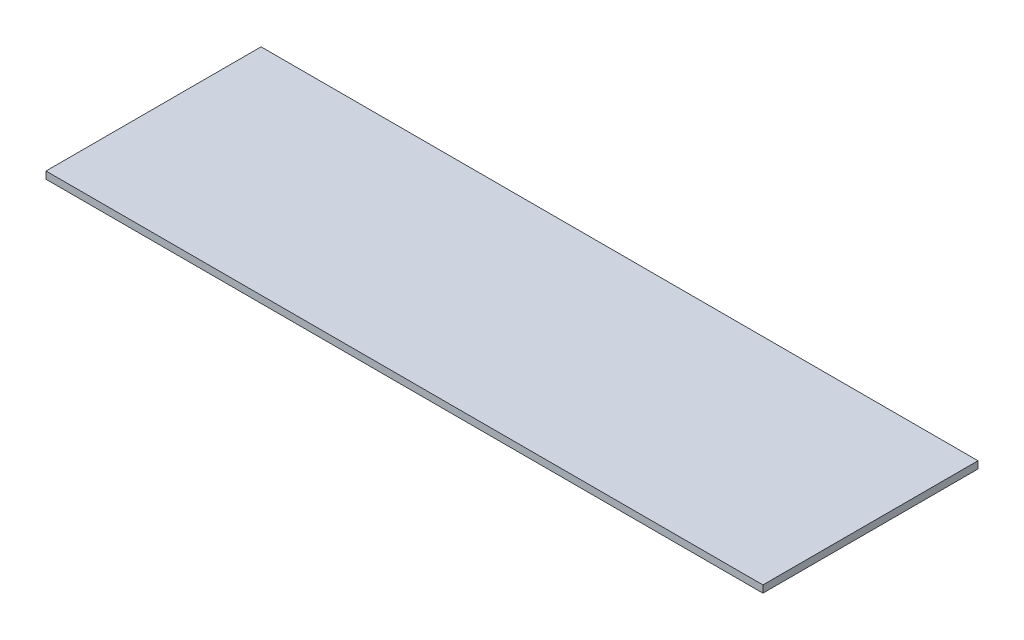
ISO-10303-21;
HEADER;
FILE_DESCRIPTION(('STEP AP214'),'2;1');
FILE_NAME('part.step','',(''),(''),'','','');
FILE_SCHEMA(('AUTOMOTIVE_DESIGN { 1 0 10303 214 1 1 1 1 }'));
ENDSEC;
DATA;
#1=APPLICATION_CONTEXT('core data for automotive mechanical design processes');
#2=APPLICATION_PROTOCOL_DEFINITION('international standard','automotive_design',2000,#1);
#3=PRODUCT_CONTEXT('',#1,'mechanical');
#4=PRODUCT('Part','Part','',(#3));
#5=PRODUCT_RELATED_PRODUCT_CATEGORY('part','',(#4));
#6=PRODUCT_DEFINITION_FORMATION('','',#4);
#7=PRODUCT_DEFINITION_CONTEXT('part definition',#1,'design');
#8=PRODUCT_DEFINITION('design','',#6,#7);
#9=PRODUCT_DEFINITION_SHAPE('','',#8);
#10=(LENGTH_UNIT() NAMED_UNIT(*) SI_UNIT(.MILLI.,.METRE.));
#11=(NAMED_UNIT(*) PLANE_ANGLE_UNIT() SI_UNIT($,.RADIAN.));
#12=(NAMED_UNIT(*) SI_UNIT($,.STERADIAN.) SOLID_ANGLE_UNIT());
#13=UNCERTAINTY_MEASURE_WITH_UNIT(LENGTH_MEASURE(1.E-05),#10,'distance_accuracy_value','');
#14=(GEOMETRIC_REPRESENTATION_CONTEXT(3) GLOBAL_UNCERTAINTY_ASSIGNED_CONTEXT((#13)) GLOBAL_UNIT_ASSIGNED_CONTEXT((#10,
#11,#12)) REPRESENTATION_CONTEXT('',''));
#15=CARTESIAN_POINT('',(0.,0.,0.));
#16=DIRECTION('',(0.,0.,1.));
#17=DIRECTION('',(1.,0.,0.));
#18=AXIS2_PLACEMENT_3D('',#15,#16,#17);
#19=CARTESIAN_POINT('',(0.,10.,0.));
#20=DIRECTION('',(-1.,0.,0.));
#21=DIRECTION('',(0.,0.,1.));
#22=AXIS2_PLACEMENT_3D('',#19,#20,#21);
#23=PLANE('',#22);
#24=DIRECTION('',(0.,0.,-1.));
#25=VECTOR('',#24,1.);
#26=CARTESIAN_POINT('',(0.,0.,0.));
#27=LINE('',#26,#25);
#28=CARTESIAN_POINT('',(0.,0.,0.));
#29=VERTEX_POINT('',#28);
#30=CARTESIAN_POINT('',(0.,0.,-300.));
#31=VERTEX_POINT('',#30);
#32=EDGE_CURVE('E77',#29,#31,#27,.T.);
#33=ORIENTED_EDGE('',*,*,#32,.T.);
#34=DIRECTION('',(0.,-1.,0.));
#35=VECTOR('',#34,1.);
#36=CARTESIAN_POINT('',(0.,10.,-300.));
#37=LINE('',#36,#35);
#38=CARTESIAN_POINT('',(0.,10.,-300.));
#39=VERTEX_POINT('',#38);
#40=EDGE_CURVE('E11',#39,#31,#37,.T.);
#41=ORIENTED_EDGE('',*,*,#40,.F.);
#42=DIRECTION('',(0.,0.,-1.));
#43=VECTOR('',#42,1.);
#44=CARTESIAN_POINT('',(0.,10.,0.));
#45=LINE('',#44,#43);
#46=CARTESIAN_POINT('',(0.,10.,0.));
#47=VERTEX_POINT('',#46);
#48=EDGE_CURVE('E95',#47,#39,#45,.T.);
#49=ORIENTED_EDGE('',*,*,#48,.F.);
#50=DIRECTION('',(0.,-1.,0.));
#51=VECTOR('',#50,1.);
#52=CARTESIAN_POINT('',(0.,10.,0.));
#53=LINE('',#52,#51);
#54=EDGE_CURVE('E89',#47,#29,#53,.T.);
#55=ORIENTED_EDGE('',*,*,#54,.T.);
#56=EDGE_LOOP('',(#33,#41,#49,#55));
#57=FACE_BOUND('',#56,.T.);
#58=ADVANCED_FACE('F33',(#57),#23,.F.);
#59=CARTESIAN_POINT('',(0.,10.,-300.));
#60=DIRECTION('',(0.,0.,1.));
#61=DIRECTION('',(1.,0.,0.));
#62=AXIS2_PLACEMENT_3D('',#59,#60,#61);
#63=PLANE('',#62);
#64=DIRECTION('',(-1.,0.,0.));
#65=VECTOR('',#64,1.);
#66=CARTESIAN_POINT('',(0.,0.,-300.));
#67=LINE('',#66,#65);
#68=CARTESIAN_POINT('',(-1000.,0.,-300.));
#69=VERTEX_POINT('',#68);
#70=EDGE_CURVE('E73',#31,#69,#67,.T.);
#71=ORIENTED_EDGE('',*,*,#70,.T.);
#72=DIRECTION('',(0.,-1.,0.));
#73=VECTOR('',#72,1.);
#74=CARTESIAN_POINT('',(-1000.,10.,-300.));
#75=LINE('',#74,#73);
#76=CARTESIAN_POINT('',(-1000.,10.,-300.));
#77=VERTEX_POINT('',#76);
#78=EDGE_CURVE('E40',#77,#69,#75,.T.);
#79=ORIENTED_EDGE('',*,*,#78,.F.);
#80=DIRECTION('',(-1.,0.,0.));
#81=VECTOR('',#80,1.);
#82=CARTESIAN_POINT('',(0.,10.,-300.));
#83=LINE('',#82,#81);
#84=EDGE_CURVE('E85',#39,#77,#83,.T.);
#85=ORIENTED_EDGE('',*,*,#84,.F.);
#86=ORIENTED_EDGE('',*,*,#40,.T.);
#87=EDGE_LOOP('',(#71,#79,#85,#86));
#88=FACE_BOUND('',#87,.T.);
#89=ADVANCED_FACE('F84',(#88),#63,.F.);
#90=CARTESIAN_POINT('',(-1000.,10.,1.22460635382238E-13));
#91=DIRECTION('',(1.,0.,0.));
#92=DIRECTION('',(0.,0.,-1.));
#93=AXIS2_PLACEMENT_3D('',#90,#91,#92);
#94=PLANE('',#93);
#95=DIRECTION('',(0.,0.,1.));
#96=VECTOR('',#95,1.);
#97=CARTESIAN_POINT('',(-1000.,0.,1.22460635382238E-13));
#98=LINE('',#97,#96);
#99=CARTESIAN_POINT('',(-1000.,0.,1.22460635382238E-13));
#100=VERTEX_POINT('',#99);
#101=EDGE_CURVE('E78',#69,#100,#98,.T.);
#102=ORIENTED_EDGE('',*,*,#101,.T.);
#103=DIRECTION('',(0.,-1.,0.));
#104=VECTOR('',#103,1.);
#105=CARTESIAN_POINT('',(-1000.,10.,1.22460635382238E-13));
#106=LINE('',#105,#104);
#107=CARTESIAN_POINT('',(-1000.,10.,1.22460635382238E-13));
#108=VERTEX_POINT('',#107);
#109=EDGE_CURVE('E101',#108,#100,#106,.T.);
#110=ORIENTED_EDGE('',*,*,#109,.F.);
#111=DIRECTION('',(0.,0.,1.));
#112=VECTOR('',#111,1.);
#113=CARTESIAN_POINT('',(-1000.,10.,1.22460635382238E-13));
#114=LINE('',#113,#112);
#115=EDGE_CURVE('E52',#77,#108,#114,.T.);
#116=ORIENTED_EDGE('',*,*,#115,.F.);
#117=ORIENTED_EDGE('',*,*,#78,.T.);
#118=EDGE_LOOP('',(#102,#110,#116,#117));
#119=FACE_BOUND('',#118,.T.);
#120=ADVANCED_FACE('F104',(#119),#94,.F.);
#121=CARTESIAN_POINT('',(0.,10.,0.));
#122=DIRECTION('',(0.,0.,-1.));
#123=DIRECTION('',(-1.,0.,0.));
#124=AXIS2_PLACEMENT_3D('',#121,#122,#123);
#125=PLANE('',#124);
#126=DIRECTION('',(1.,0.,0.));
#127=VECTOR('',#126,1.);
#128=CARTESIAN_POINT('',(0.,0.,0.));
#129=LINE('',#128,#127);
#130=EDGE_CURVE('E93',#100,#29,#129,.T.);
#131=ORIENTED_EDGE('',*,*,#130,.T.);
#132=ORIENTED_EDGE('',*,*,#54,.F.);
#133=DIRECTION('',(1.,0.,0.));
#134=VECTOR('',#133,1.);
#135=CARTESIAN_POINT('',(0.,10.,0.));
#136=LINE('',#135,#134);
#137=EDGE_CURVE('E47',#108,#47,#136,.T.);
#138=ORIENTED_EDGE('',*,*,#137,.F.);
#139=ORIENTED_EDGE('',*,*,#109,.T.);
#140=EDGE_LOOP('',(#131,#132,#138,#139));
#141=FACE_BOUND('',#140,.T.);
#142=ADVANCED_FACE('F106',(#141),#125,.F.);
#143=CARTESIAN_POINT('',(0.,10.,0.));
#144=DIRECTION('',(0.,1.,0.));
#145=DIRECTION('',(0.,0.,1.));
#146=AXIS2_PLACEMENT_3D('',#143,#144,#145);
#147=PLANE('',#146);
#148=ORIENTED_EDGE('',*,*,#48,.T.);
#149=ORIENTED_EDGE('',*,*,#84,.T.);
#150=ORIENTED_EDGE('',*,*,#115,.T.);
#151=ORIENTED_EDGE('',*,*,#137,.T.);
#152=EDGE_LOOP('',(#148,#149,#150,#151));
#153=FACE_BOUND('',#152,.T.);
#154=ADVANCED_FACE('F107',(#153),#147,.T.);
#155=CARTESIAN_POINT('',(0.,0.,0.));
#156=DIRECTION('',(0.,1.,0.));
#157=DIRECTION('',(0.,0.,1.));
#158=AXIS2_PLACEMENT_3D('',#155,#156,#157);
#159=PLANE('',#158);
#160=ORIENTED_EDGE('',*,*,#32,.F.);
#161=ORIENTED_EDGE('',*,*,#130,.F.);
#162=ORIENTED_EDGE('',*,*,#101,.F.);
#163=ORIENTED_EDGE('',*,*,#70,.F.);
#164=EDGE_LOOP('',(#160,#161,#162,#163));
#165=FACE_BOUND('',#164,.T.);
#166=ADVANCED_FACE('F74',(#165),#159,.F.);
#167=CLOSED_SHELL('',(#58,#89,#120,#142,#154,#166));
#168=MANIFOLD_SOLID_BREP('B2',#167);
#169=ADVANCED_BREP_SHAPE_REPRESENTATION('',(#18,#168),#14);
#170=SHAPE_DEFINITION_REPRESENTATION(#9,#169);
ENDSEC;
END-ISO-10303-21;
